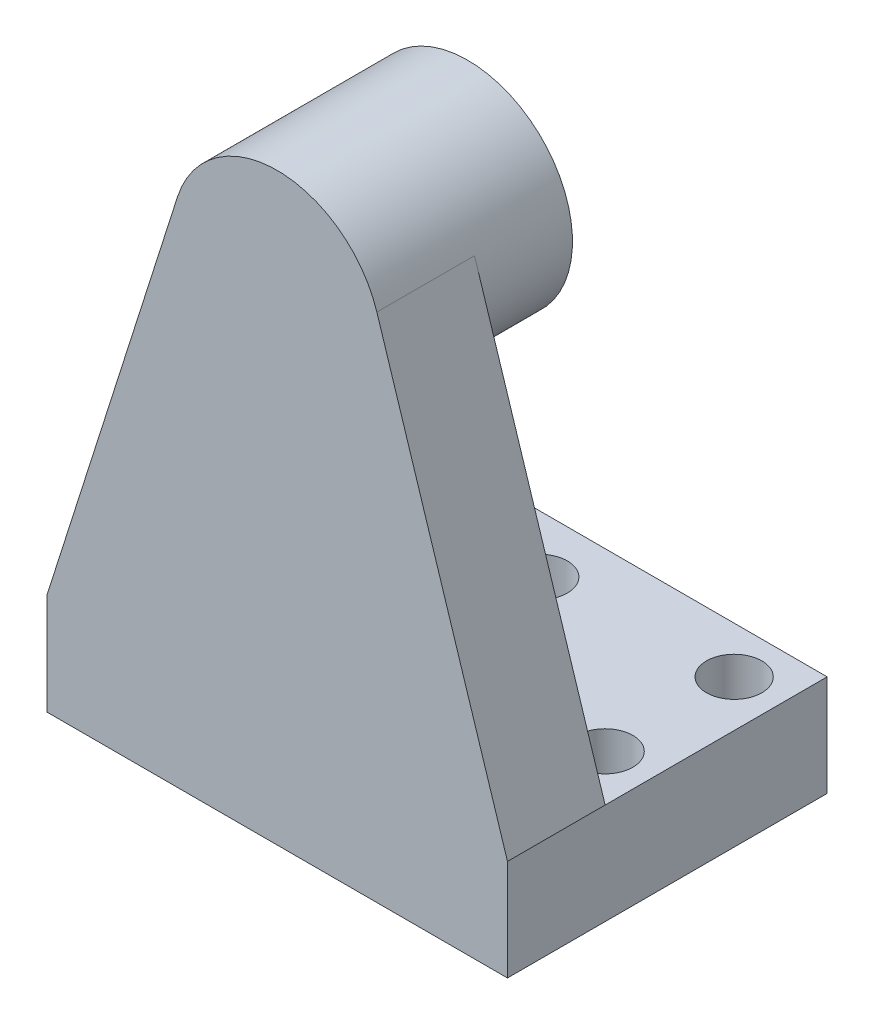
ISO-10303-21;
HEADER;
FILE_DESCRIPTION(('STEP AP214'),'2;1');
FILE_NAME('part.step','',(''),(''),'','','');
FILE_SCHEMA(('AUTOMOTIVE_DESIGN { 1 0 10303 214 1 1 1 1 }'));
ENDSEC;
DATA;
#1=APPLICATION_CONTEXT('core data for automotive mechanical design processes');
#2=APPLICATION_PROTOCOL_DEFINITION('international standard','automotive_design',2000,#1);
#3=PRODUCT_CONTEXT('',#1,'mechanical');
#4=PRODUCT('Part','Part','',(#3));
#5=PRODUCT_RELATED_PRODUCT_CATEGORY('part','',(#4));
#6=PRODUCT_DEFINITION_FORMATION('','',#4);
#7=PRODUCT_DEFINITION_CONTEXT('part definition',#1,'design');
#8=PRODUCT_DEFINITION('design','',#6,#7);
#9=PRODUCT_DEFINITION_SHAPE('','',#8);
#10=(LENGTH_UNIT() NAMED_UNIT(*) SI_UNIT(.MILLI.,.METRE.));
#11=(NAMED_UNIT(*) PLANE_ANGLE_UNIT() SI_UNIT($,.RADIAN.));
#12=(NAMED_UNIT(*) SI_UNIT($,.STERADIAN.) SOLID_ANGLE_UNIT());
#13=UNCERTAINTY_MEASURE_WITH_UNIT(LENGTH_MEASURE(1.E-05),#10,'distance_accuracy_value','');
#14=(GEOMETRIC_REPRESENTATION_CONTEXT(3) GLOBAL_UNCERTAINTY_ASSIGNED_CONTEXT((#13)) GLOBAL_UNIT_ASSIGNED_CONTEXT((#10,
#11,#12)) REPRESENTATION_CONTEXT('',''));
#15=CARTESIAN_POINT('',(0.,0.,0.));
#16=DIRECTION('',(0.,0.,1.));
#17=DIRECTION('',(1.,0.,0.));
#18=AXIS2_PLACEMENT_3D('',#15,#16,#17);
#19=CARTESIAN_POINT('',(-17.71,-17.71,20.));
#20=DIRECTION('',(0.,0.,1.));
#21=DIRECTION('',(1.,0.,0.));
#22=AXIS2_PLACEMENT_3D('',#19,#20,#21);
#23=PLANE('',#22);
#24=CARTESIAN_POINT('',(0.,0.,20.));
#25=DIRECTION('',(0.,0.,-1.));
#26=DIRECTION('',(0.,1.,0.));
#27=AXIS2_PLACEMENT_3D('',#24,#25,#26);
#28=CIRCLE('',#27,17.5);
#29=CARTESIAN_POINT('',(0.,17.5,20.));
#30=VERTEX_POINT('',#29);
#31=EDGE_CURVE('E20',#30,#30,#28,.F.);
#32=ORIENTED_EDGE('',*,*,#31,.F.);
#33=EDGE_LOOP('',(#32));
#34=FACE_BOUND('',#33,.T.);
#35=ADVANCED_FACE('F16',(#34),#23,.F.);
#36=CARTESIAN_POINT('',(0.,0.,20.));
#37=DIRECTION('',(0.,0.,-1.));
#38=DIRECTION('',(0.,1.,0.));
#39=AXIS2_PLACEMENT_3D('',#36,#37,#38);
#40=CYLINDRICAL_SURFACE('',#39,17.5);
#41=CARTESIAN_POINT('',(0.,0.,0.));
#42=DIRECTION('',(0.,0.,-1.));
#43=DIRECTION('',(0.,1.,0.));
#44=AXIS2_PLACEMENT_3D('',#41,#42,#43);
#45=CIRCLE('',#44,17.5);
#46=CARTESIAN_POINT('',(0.,17.5,0.));
#47=VERTEX_POINT('',#46);
#48=EDGE_CURVE('E103',#47,#47,#45,.T.);
#49=ORIENTED_EDGE('',*,*,#48,.T.);
#50=EDGE_LOOP('',(#49));
#51=FACE_BOUND('',#50,.T.);
#52=ORIENTED_EDGE('',*,*,#31,.T.);
#53=EDGE_LOOP('',(#52));
#54=FACE_BOUND('',#53,.T.);
#55=ADVANCED_FACE('F110',(#51,#54),#40,.F.);
#56=CARTESIAN_POINT('',(-22.77,-22.77,0.));
#57=DIRECTION('',(0.,0.,1.));
#58=DIRECTION('',(1.,0.,0.));
#59=AXIS2_PLACEMENT_3D('',#56,#57,#58);
#60=PLANE('',#59);
#61=ORIENTED_EDGE('',*,*,#48,.F.);
#62=EDGE_LOOP('',(#61));
#63=FACE_BOUND('',#62,.T.);
#64=CARTESIAN_POINT('',(0.,0.,0.));
#65=DIRECTION('',(0.,0.,-1.));
#66=DIRECTION('',(-1.,0.,0.));
#67=AXIS2_PLACEMENT_3D('',#64,#65,#66);
#68=CIRCLE('',#67,22.5);
#69=CARTESIAN_POINT('',(-22.5,0.,0.));
#70=VERTEX_POINT('',#69);
#71=EDGE_CURVE('E101',#70,#70,#68,.T.);
#72=ORIENTED_EDGE('',*,*,#71,.T.);
#73=EDGE_LOOP('',(#72));
#74=FACE_BOUND('',#73,.T.);
#75=ADVANCED_FACE('F118',(#63,#74),#60,.F.);
#76=CARTESIAN_POINT('',(0.,0.,41.));
#77=DIRECTION('',(0.,0.,-1.));
#78=DIRECTION('',(-1.,0.,0.));
#79=AXIS2_PLACEMENT_3D('',#76,#77,#78);
#80=CYLINDRICAL_SURFACE('',#79,22.5);
#81=ORIENTED_EDGE('',*,*,#71,.F.);
#82=EDGE_LOOP('',(#81));
#83=FACE_BOUND('',#82,.T.);
#84=DIRECTION('',(0.,0.,-1.));
#85=VECTOR('',#84,1.);
#86=CARTESIAN_POINT('',(21.440276778,6.8238209,30.5));
#87=LINE('',#86,#85);
#88=CARTESIAN_POINT('',(21.4402767586442,6.82382089771802,41.));
#89=VERTEX_POINT('',#88);
#90=CARTESIAN_POINT('',(21.4402767780002,6.82382089999947,19.999999999));
#91=VERTEX_POINT('',#90);
#92=EDGE_CURVE('E84',#89,#91,#87,.T.);
#93=ORIENTED_EDGE('',*,*,#92,.T.);
#94=CARTESIAN_POINT('',(0.,0.,19.999999998));
#95=DIRECTION('',(0.,0.,-1.));
#96=DIRECTION('',(-1.,0.,0.));
#97=AXIS2_PLACEMENT_3D('',#94,#95,#96);
#98=CIRCLE('',#97,22.5);
#99=CARTESIAN_POINT('',(-21.4402767780002,6.82382089999948,19.999999999));
#100=VERTEX_POINT('',#99);
#101=EDGE_CURVE('E78',#91,#100,#98,.T.);
#102=ORIENTED_EDGE('',*,*,#101,.T.);
#103=DIRECTION('',(0.,0.,1.));
#104=VECTOR('',#103,1.);
#105=CARTESIAN_POINT('',(-21.440276778,6.8238209,30.5));
#106=LINE('',#105,#104);
#107=CARTESIAN_POINT('',(-21.4402767586442,6.82382089771802,41.));
#108=VERTEX_POINT('',#107);
#109=EDGE_CURVE('E73',#100,#108,#106,.T.);
#110=ORIENTED_EDGE('',*,*,#109,.T.);
#111=CARTESIAN_POINT('',(0.,0.,41.));
#112=DIRECTION('',(0.,0.,-1.));
#113=DIRECTION('',(-1.,0.,0.));
#114=AXIS2_PLACEMENT_3D('',#111,#112,#113);
#115=CIRCLE('',#114,22.5);
#116=EDGE_CURVE('E77',#89,#108,#115,.F.);
#117=ORIENTED_EDGE('',*,*,#116,.F.);
#118=EDGE_LOOP('',(#93,#102,#110,#117));
#119=FACE_BOUND('',#118,.T.);
#120=ADVANCED_FACE('F76',(#83,#119),#80,.T.);
#121=CARTESIAN_POINT('',(21.440276778,6.8238209,20.));
#122=DIRECTION('',(-0.952901190140385,-0.303280928891082,0.));
#123=DIRECTION('',(0.303280928891082,-0.952901190140385,0.));
#124=AXIS2_PLACEMENT_3D('',#121,#122,#123);
#125=PLANE('',#124);
#126=ORIENTED_EDGE('',*,*,#92,.F.);
#127=DIRECTION('',(-0.303280929204166,0.95290119004074,0.));
#128=VECTOR('',#127,1.);
#129=CARTESIAN_POINT('',(49.529318223,-81.4312537878578,41.));
#130=LINE('',#129,#128);
#131=CARTESIAN_POINT('',(49.529318223,-81.4312537749289,41.));
#132=VERTEX_POINT('',#131);
#133=EDGE_CURVE('E93',#132,#89,#130,.T.);
#134=ORIENTED_EDGE('',*,*,#133,.F.);
#135=DIRECTION('',(0.,0.,-1.));
#136=VECTOR('',#135,1.);
#137=CARTESIAN_POINT('',(49.529318223,-81.431253762,6.628008068));
#138=LINE('',#137,#136);
#139=CARTESIAN_POINT('',(49.529318223,-81.431253762,20.));
#140=VERTEX_POINT('',#139);
#141=EDGE_CURVE('E230',#132,#140,#138,.T.);
#142=ORIENTED_EDGE('',*,*,#141,.T.);
#143=DIRECTION('',(0.303280928891082,-0.952901190140385,0.));
#144=VECTOR('',#143,1.);
#145=CARTESIAN_POINT('',(21.440276778,6.8238209,20.));
#146=LINE('',#145,#144);
#147=EDGE_CURVE('E244',#140,#91,#146,.F.);
#148=ORIENTED_EDGE('',*,*,#147,.T.);
#149=EDGE_LOOP('',(#126,#134,#142,#148));
#150=FACE_BOUND('',#149,.T.);
#151=ADVANCED_FACE('F150',(#150),#125,.F.);
#152=CARTESIAN_POINT('',(-49.529318223,-81.431253762,20.));
#153=DIRECTION('',(0.952901190140385,-0.303280928891082,0.));
#154=DIRECTION('',(0.303280928891082,0.952901190140385,0.));
#155=AXIS2_PLACEMENT_3D('',#152,#153,#154);
#156=PLANE('',#155);
#157=DIRECTION('',(0.,0.,1.));
#158=VECTOR('',#157,1.);
#159=CARTESIAN_POINT('',(-49.529318223,-81.431253762,6.628008068));
#160=LINE('',#159,#158);
#161=CARTESIAN_POINT('',(-49.529318223,-81.431253762,20.));
#162=VERTEX_POINT('',#161);
#163=CARTESIAN_POINT('',(-49.529318223,-81.4312537749289,41.));
#164=VERTEX_POINT('',#163);
#165=EDGE_CURVE('E97',#162,#164,#160,.T.);
#166=ORIENTED_EDGE('',*,*,#165,.T.);
#167=DIRECTION('',(-0.303280929204166,-0.952901190040739,0.));
#168=VECTOR('',#167,1.);
#169=CARTESIAN_POINT('',(-21.4402767304418,6.82382092323203,41.));
#170=LINE('',#169,#168);
#171=EDGE_CURVE('E83',#108,#164,#170,.T.);
#172=ORIENTED_EDGE('',*,*,#171,.F.);
#173=ORIENTED_EDGE('',*,*,#109,.F.);
#174=DIRECTION('',(0.303280928891082,0.952901190140385,0.));
#175=VECTOR('',#174,1.);
#176=CARTESIAN_POINT('',(-49.529318223,-81.431253762,20.));
#177=LINE('',#176,#175);
#178=EDGE_CURVE('E264',#100,#162,#177,.F.);
#179=ORIENTED_EDGE('',*,*,#178,.T.);
#180=EDGE_LOOP('',(#166,#172,#173,#179));
#181=FACE_BOUND('',#180,.T.);
#182=ADVANCED_FACE('F96',(#181),#156,.F.);
#183=CARTESIAN_POINT('',(-49.529318223,-103.146254765,41.));
#184=DIRECTION('',(0.,0.,1.));
#185=DIRECTION('',(1.,0.,0.));
#186=AXIS2_PLACEMENT_3D('',#183,#184,#185);
#187=PLANE('',#186);
#188=ORIENTED_EDGE('',*,*,#133,.T.);
#189=ORIENTED_EDGE('',*,*,#116,.T.);
#190=ORIENTED_EDGE('',*,*,#171,.T.);
#191=DIRECTION('',(0.,-1.,0.));
#192=VECTOR('',#191,1.);
#193=CARTESIAN_POINT('',(-49.529318223,-92.2887542635,41.));
#194=LINE('',#193,#192);
#195=CARTESIAN_POINT('',(-49.529318223,-103.146254765,41.));
#196=VERTEX_POINT('',#195);
#197=EDGE_CURVE('E228',#164,#196,#194,.T.);
#198=ORIENTED_EDGE('',*,*,#197,.T.);
#199=DIRECTION('',(1.,0.,0.));
#200=VECTOR('',#199,1.);
#201=CARTESIAN_POINT('',(0.,-103.146254765,41.));
#202=LINE('',#201,#200);
#203=CARTESIAN_POINT('',(49.529318223,-103.146254765,41.));
#204=VERTEX_POINT('',#203);
#205=EDGE_CURVE('E221',#196,#204,#202,.T.);
#206=ORIENTED_EDGE('',*,*,#205,.T.);
#207=DIRECTION('',(0.,1.,0.));
#208=VECTOR('',#207,1.);
#209=CARTESIAN_POINT('',(49.529318223,-92.2887542635,41.));
#210=LINE('',#209,#208);
#211=EDGE_CURVE('E220',#204,#132,#210,.T.);
#212=ORIENTED_EDGE('',*,*,#211,.T.);
#213=EDGE_LOOP('',(#188,#189,#190,#198,#206,#212));
#214=FACE_BOUND('',#213,.T.);
#215=ADVANCED_FACE('F89',(#214),#187,.T.);
#216=CARTESIAN_POINT('',(-50.123670041,-81.431253762,20.));
#217=DIRECTION('',(0.,0.,1.));
#218=DIRECTION('',(1.,0.,0.));
#219=AXIS2_PLACEMENT_3D('',#216,#217,#218);
#220=PLANE('',#219);
#221=DIRECTION('',(1.,0.,0.));
#222=VECTOR('',#221,1.);
#223=CARTESIAN_POINT('',(0.,-81.431253762,20.));
#224=LINE('',#223,#222);
#225=EDGE_CURVE('E232',#162,#140,#224,.T.);
#226=ORIENTED_EDGE('',*,*,#225,.F.);
#227=ORIENTED_EDGE('',*,*,#178,.F.);
#228=ORIENTED_EDGE('',*,*,#101,.F.);
#229=ORIENTED_EDGE('',*,*,#147,.F.);
#230=EDGE_LOOP('',(#226,#227,#228,#229));
#231=FACE_BOUND('',#230,.T.);
#232=ADVANCED_FACE('F168',(#231),#220,.F.);
#233=CARTESIAN_POINT('',(49.529318223,-103.146254765,-27.743983864));
#234=DIRECTION('',(-1.,0.,0.));
#235=DIRECTION('',(0.,0.,1.));
#236=AXIS2_PLACEMENT_3D('',#233,#234,#235);
#237=PLANE('',#236);
#238=DIRECTION('',(0.,-1.,0.));
#239=VECTOR('',#238,1.);
#240=CARTESIAN_POINT('',(49.529318223,-92.2887542635,-27.743983864));
#241=LINE('',#240,#239);
#242=CARTESIAN_POINT('',(49.529318223,-81.431253762,-27.743983864));
#243=VERTEX_POINT('',#242);
#244=CARTESIAN_POINT('',(49.529318223,-103.146254765,-27.743983864));
#245=VERTEX_POINT('',#244);
#246=EDGE_CURVE('E218',#243,#245,#241,.T.);
#247=ORIENTED_EDGE('',*,*,#246,.F.);
#248=DIRECTION('',(0.,0.,-1.));
#249=VECTOR('',#248,1.);
#250=CARTESIAN_POINT('',(49.529318223,-81.431253762,-3.871991932));
#251=LINE('',#250,#249);
#252=EDGE_CURVE('E235',#140,#243,#251,.T.);
#253=ORIENTED_EDGE('',*,*,#252,.F.);
#254=ORIENTED_EDGE('',*,*,#141,.F.);
#255=ORIENTED_EDGE('',*,*,#211,.F.);
#256=DIRECTION('',(0.,0.,-1.));
#257=VECTOR('',#256,1.);
#258=CARTESIAN_POINT('',(49.529318223,-103.146254765,6.628008068));
#259=LINE('',#258,#257);
#260=EDGE_CURVE('E211',#204,#245,#259,.T.);
#261=ORIENTED_EDGE('',*,*,#260,.T.);
#262=EDGE_LOOP('',(#247,#253,#254,#255,#261));
#263=FACE_BOUND('',#262,.T.);
#264=ADVANCED_FACE('F171',(#263),#237,.F.);
#265=CARTESIAN_POINT('',(49.529318223,-103.146254765,-27.743983864));
#266=DIRECTION('',(0.,0.,-1.));
#267=DIRECTION('',(-1.,0.,0.));
#268=AXIS2_PLACEMENT_3D('',#265,#266,#267);
#269=PLANE('',#268);
#270=DIRECTION('',(-1.,0.,0.));
#271=VECTOR('',#270,1.);
#272=CARTESIAN_POINT('',(0.,-81.431253762,-27.743983864));
#273=LINE('',#272,#271);
#274=CARTESIAN_POINT('',(-49.529318223,-81.431253762,-27.743983864));
#275=VERTEX_POINT('',#274);
#276=EDGE_CURVE('E35',#243,#275,#273,.T.);
#277=ORIENTED_EDGE('',*,*,#276,.F.);
#278=ORIENTED_EDGE('',*,*,#246,.T.);
#279=DIRECTION('',(-1.,0.,0.));
#280=VECTOR('',#279,1.);
#281=CARTESIAN_POINT('',(0.,-103.146254765,-27.743983864));
#282=LINE('',#281,#280);
#283=CARTESIAN_POINT('',(-49.529318223,-103.146254765,-27.743983864));
#284=VERTEX_POINT('',#283);
#285=EDGE_CURVE('E209',#245,#284,#282,.T.);
#286=ORIENTED_EDGE('',*,*,#285,.T.);
#287=DIRECTION('',(0.,1.,0.));
#288=VECTOR('',#287,1.);
#289=CARTESIAN_POINT('',(-49.529318223,-92.2887542635,-27.743983864));
#290=LINE('',#289,#288);
#291=EDGE_CURVE('E226',#284,#275,#290,.T.);
#292=ORIENTED_EDGE('',*,*,#291,.T.);
#293=EDGE_LOOP('',(#277,#278,#286,#292));
#294=FACE_BOUND('',#293,.T.);
#295=ADVANCED_FACE('F175',(#294),#269,.T.);
#296=CARTESIAN_POINT('',(-49.529318223,-103.146254765,41.));
#297=DIRECTION('',(1.,0.,0.));
#298=DIRECTION('',(0.,0.,-1.));
#299=AXIS2_PLACEMENT_3D('',#296,#297,#298);
#300=PLANE('',#299);
#301=DIRECTION('',(0.,0.,1.));
#302=VECTOR('',#301,1.);
#303=CARTESIAN_POINT('',(-49.529318223,-81.431253762,-3.871991932));
#304=LINE('',#303,#302);
#305=EDGE_CURVE('E240',#275,#162,#304,.T.);
#306=ORIENTED_EDGE('',*,*,#305,.F.);
#307=ORIENTED_EDGE('',*,*,#291,.F.);
#308=DIRECTION('',(0.,0.,1.));
#309=VECTOR('',#308,1.);
#310=CARTESIAN_POINT('',(-49.529318223,-103.146254765,6.628008068));
#311=LINE('',#310,#309);
#312=EDGE_CURVE('E214',#284,#196,#311,.T.);
#313=ORIENTED_EDGE('',*,*,#312,.T.);
#314=ORIENTED_EDGE('',*,*,#197,.F.);
#315=ORIENTED_EDGE('',*,*,#165,.F.);
#316=EDGE_LOOP('',(#306,#307,#313,#314,#315));
#317=FACE_BOUND('',#316,.T.);
#318=ADVANCED_FACE('F147',(#317),#300,.F.);
#319=CARTESIAN_POINT('',(-39.529318223,-103.146254765,-17.743983864));
#320=DIRECTION('',(0.,1.,0.));
#321=DIRECTION('',(0.,0.,1.));
#322=AXIS2_PLACEMENT_3D('',#319,#320,#321);
#323=CYLINDRICAL_SURFACE('',#322,5.95249);
#324=CARTESIAN_POINT('',(-39.529318223,-81.431253762,-17.743983864));
#325=DIRECTION('',(0.,1.,0.));
#326=DIRECTION('',(0.,0.,1.));
#327=AXIS2_PLACEMENT_3D('',#324,#325,#326);
#328=CIRCLE('',#327,5.95249);
#329=CARTESIAN_POINT('',(-39.529318223,-81.431253762,-11.791493864));
#330=VERTEX_POINT('',#329);
#331=EDGE_CURVE('E242',#330,#330,#328,.F.);
#332=ORIENTED_EDGE('',*,*,#331,.F.);
#333=EDGE_LOOP('',(#332));
#334=FACE_BOUND('',#333,.T.);
#335=CARTESIAN_POINT('',(-39.529318223,-103.146254765,-17.743983864));
#336=DIRECTION('',(0.,1.,0.));
#337=DIRECTION('',(0.,0.,1.));
#338=AXIS2_PLACEMENT_3D('',#335,#336,#337);
#339=CIRCLE('',#338,5.95249);
#340=CARTESIAN_POINT('',(-39.529318223,-103.146254765,-11.791493864));
#341=VERTEX_POINT('',#340);
#342=EDGE_CURVE('E201',#341,#341,#339,.F.);
#343=ORIENTED_EDGE('',*,*,#342,.T.);
#344=EDGE_LOOP('',(#343));
#345=FACE_BOUND('',#344,.T.);
#346=ADVANCED_FACE('F143',(#334,#345),#323,.F.);
#347=CARTESIAN_POINT('',(-39.529318223,-103.146254765,10.));
#348=DIRECTION('',(0.,1.,0.));
#349=DIRECTION('',(0.,0.,1.));
#350=AXIS2_PLACEMENT_3D('',#347,#348,#349);
#351=CYLINDRICAL_SURFACE('',#350,5.95249);
#352=CARTESIAN_POINT('',(-39.529318223,-81.431253762,10.));
#353=DIRECTION('',(0.,1.,0.));
#354=DIRECTION('',(0.,0.,1.));
#355=AXIS2_PLACEMENT_3D('',#352,#353,#354);
#356=CIRCLE('',#355,5.95249);
#357=CARTESIAN_POINT('',(-39.529318223,-81.431253762,15.95249));
#358=VERTEX_POINT('',#357);
#359=EDGE_CURVE('E253',#358,#358,#356,.F.);
#360=ORIENTED_EDGE('',*,*,#359,.F.);
#361=EDGE_LOOP('',(#360));
#362=FACE_BOUND('',#361,.T.);
#363=CARTESIAN_POINT('',(-39.529318223,-103.146254765,10.));
#364=DIRECTION('',(0.,1.,0.));
#365=DIRECTION('',(0.,0.,1.));
#366=AXIS2_PLACEMENT_3D('',#363,#364,#365);
#367=CIRCLE('',#366,5.95249);
#368=CARTESIAN_POINT('',(-39.529318223,-103.146254765,15.95249));
#369=VERTEX_POINT('',#368);
#370=EDGE_CURVE('E197',#369,#369,#367,.F.);
#371=ORIENTED_EDGE('',*,*,#370,.T.);
#372=EDGE_LOOP('',(#371));
#373=FACE_BOUND('',#372,.T.);
#374=ADVANCED_FACE('F139',(#362,#373),#351,.F.);
#375=CARTESIAN_POINT('',(39.529318223,-103.146254765,10.));
#376=DIRECTION('',(0.,1.,0.));
#377=DIRECTION('',(0.,0.,1.));
#378=AXIS2_PLACEMENT_3D('',#375,#376,#377);
#379=CYLINDRICAL_SURFACE('',#378,5.95249);
#380=CARTESIAN_POINT('',(39.529318223,-81.431253762,10.));
#381=DIRECTION('',(0.,1.,0.));
#382=DIRECTION('',(0.,0.,1.));
#383=AXIS2_PLACEMENT_3D('',#380,#381,#382);
#384=CIRCLE('',#383,5.95249);
#385=CARTESIAN_POINT('',(39.529318223,-81.431253762,15.95249));
#386=VERTEX_POINT('',#385);
#387=EDGE_CURVE('E250',#386,#386,#384,.F.);
#388=ORIENTED_EDGE('',*,*,#387,.F.);
#389=EDGE_LOOP('',(#388));
#390=FACE_BOUND('',#389,.T.);
#391=CARTESIAN_POINT('',(39.529318223,-103.146254765,10.));
#392=DIRECTION('',(0.,1.,0.));
#393=DIRECTION('',(0.,0.,1.));
#394=AXIS2_PLACEMENT_3D('',#391,#392,#393);
#395=CIRCLE('',#394,5.95249);
#396=CARTESIAN_POINT('',(39.529318223,-103.146254765,15.95249));
#397=VERTEX_POINT('',#396);
#398=EDGE_CURVE('E193',#397,#397,#395,.F.);
#399=ORIENTED_EDGE('',*,*,#398,.T.);
#400=EDGE_LOOP('',(#399));
#401=FACE_BOUND('',#400,.T.);
#402=ADVANCED_FACE('F135',(#390,#401),#379,.F.);
#403=CARTESIAN_POINT('',(0.,-103.146254765,-15.406497002));
#404=DIRECTION('',(0.,1.,0.));
#405=DIRECTION('',(0.,0.,1.));
#406=AXIS2_PLACEMENT_3D('',#403,#404,#405);
#407=CYLINDRICAL_SURFACE('',#406,6.);
#408=CARTESIAN_POINT('',(0.,-81.431253762,-15.406497002));
#409=DIRECTION('',(0.,1.,0.));
#410=DIRECTION('',(0.,0.,1.));
#411=AXIS2_PLACEMENT_3D('',#408,#409,#410);
#412=CIRCLE('',#411,6.);
#413=CARTESIAN_POINT('',(0.,-81.431253762,-9.406497002));
#414=VERTEX_POINT('',#413);
#415=EDGE_CURVE('E247',#414,#414,#412,.F.);
#416=ORIENTED_EDGE('',*,*,#415,.F.);
#417=EDGE_LOOP('',(#416));
#418=FACE_BOUND('',#417,.T.);
#419=CARTESIAN_POINT('',(0.,-103.146254765,-15.406497002));
#420=DIRECTION('',(0.,1.,0.));
#421=DIRECTION('',(0.,0.,1.));
#422=AXIS2_PLACEMENT_3D('',#419,#420,#421);
#423=CIRCLE('',#422,6.);
#424=CARTESIAN_POINT('',(0.,-103.146254765,-9.406497002));
#425=VERTEX_POINT('',#424);
#426=EDGE_CURVE('E189',#425,#425,#423,.F.);
#427=ORIENTED_EDGE('',*,*,#426,.T.);
#428=EDGE_LOOP('',(#427));
#429=FACE_BOUND('',#428,.T.);
#430=ADVANCED_FACE('F132',(#418,#429),#407,.F.);
#431=CARTESIAN_POINT('',(-49.529318223,-103.146254765,-27.743983864));
#432=DIRECTION('',(0.,1.,0.));
#433=DIRECTION('',(0.,0.,1.));
#434=AXIS2_PLACEMENT_3D('',#431,#432,#433);
#435=PLANE('',#434);
#436=ORIENTED_EDGE('',*,*,#426,.F.);
#437=EDGE_LOOP('',(#436));
#438=FACE_BOUND('',#437,.T.);
#439=ORIENTED_EDGE('',*,*,#398,.F.);
#440=EDGE_LOOP('',(#439));
#441=FACE_BOUND('',#440,.T.);
#442=ORIENTED_EDGE('',*,*,#370,.F.);
#443=EDGE_LOOP('',(#442));
#444=FACE_BOUND('',#443,.T.);
#445=ORIENTED_EDGE('',*,*,#342,.F.);
#446=EDGE_LOOP('',(#445));
#447=FACE_BOUND('',#446,.T.);
#448=CARTESIAN_POINT('',(39.529318223,-103.146254765,-17.743983864));
#449=DIRECTION('',(0.,1.,0.));
#450=DIRECTION('',(0.,0.,1.));
#451=AXIS2_PLACEMENT_3D('',#448,#449,#450);
#452=CIRCLE('',#451,5.95249);
#453=CARTESIAN_POINT('',(39.529318223,-103.146254765,-11.791493864));
#454=VERTEX_POINT('',#453);
#455=EDGE_CURVE('E26',#454,#454,#452,.F.);
#456=ORIENTED_EDGE('',*,*,#455,.F.);
#457=EDGE_LOOP('',(#456));
#458=FACE_BOUND('',#457,.T.);
#459=ORIENTED_EDGE('',*,*,#285,.F.);
#460=ORIENTED_EDGE('',*,*,#260,.F.);
#461=ORIENTED_EDGE('',*,*,#205,.F.);
#462=ORIENTED_EDGE('',*,*,#312,.F.);
#463=EDGE_LOOP('',(#459,#460,#461,#462));
#464=FACE_BOUND('',#463,.T.);
#465=ADVANCED_FACE('F128',(#438,#441,#444,#447,#458,#464),#435,.F.);
#466=CARTESIAN_POINT('',(-49.529318223,-81.431253762,-27.743983864));
#467=DIRECTION('',(0.,1.,0.));
#468=DIRECTION('',(0.,0.,1.));
#469=AXIS2_PLACEMENT_3D('',#466,#467,#468);
#470=PLANE('',#469);
#471=ORIENTED_EDGE('',*,*,#415,.T.);
#472=EDGE_LOOP('',(#471));
#473=FACE_BOUND('',#472,.T.);
#474=ORIENTED_EDGE('',*,*,#387,.T.);
#475=EDGE_LOOP('',(#474));
#476=FACE_BOUND('',#475,.T.);
#477=ORIENTED_EDGE('',*,*,#359,.T.);
#478=EDGE_LOOP('',(#477));
#479=FACE_BOUND('',#478,.T.);
#480=ORIENTED_EDGE('',*,*,#331,.T.);
#481=EDGE_LOOP('',(#480));
#482=FACE_BOUND('',#481,.T.);
#483=CARTESIAN_POINT('',(39.529318223,-81.431253762,-17.743983864));
#484=DIRECTION('',(0.,1.,0.));
#485=DIRECTION('',(0.,0.,1.));
#486=AXIS2_PLACEMENT_3D('',#483,#484,#485);
#487=CIRCLE('',#486,5.95249);
#488=CARTESIAN_POINT('',(39.529318223,-81.431253762,-11.791493864));
#489=VERTEX_POINT('',#488);
#490=EDGE_CURVE('E10',#489,#489,#487,.T.);
#491=ORIENTED_EDGE('',*,*,#490,.F.);
#492=EDGE_LOOP('',(#491));
#493=FACE_BOUND('',#492,.T.);
#494=ORIENTED_EDGE('',*,*,#276,.T.);
#495=ORIENTED_EDGE('',*,*,#305,.T.);
#496=ORIENTED_EDGE('',*,*,#225,.T.);
#497=ORIENTED_EDGE('',*,*,#252,.T.);
#498=EDGE_LOOP('',(#494,#495,#496,#497));
#499=FACE_BOUND('',#498,.T.);
#500=ADVANCED_FACE('F18',(#473,#476,#479,#482,#493,#499),#470,.T.);
#501=CARTESIAN_POINT('',(39.529318223,-103.146254765,-17.743983864));
#502=DIRECTION('',(0.,1.,0.));
#503=DIRECTION('',(0.,0.,1.));
#504=AXIS2_PLACEMENT_3D('',#501,#502,#503);
#505=CYLINDRICAL_SURFACE('',#504,5.95249);
#506=ORIENTED_EDGE('',*,*,#490,.T.);
#507=EDGE_LOOP('',(#506));
#508=FACE_BOUND('',#507,.T.);
#509=ORIENTED_EDGE('',*,*,#455,.T.);
#510=EDGE_LOOP('',(#509));
#511=FACE_BOUND('',#510,.T.);
#512=ADVANCED_FACE('F121',(#508,#511),#505,.F.);
#513=CLOSED_SHELL('',(#35,#55,#75,#120,#151,#182,#215,#232,#264,#295,#318,#346,#374,#402,#430,
#465,#500,#512));
#514=MANIFOLD_SOLID_BREP('B1',#513);
#515=ADVANCED_BREP_SHAPE_REPRESENTATION('',(#18,#514),#14);
#516=SHAPE_DEFINITION_REPRESENTATION(#9,#515);
ENDSEC;
END-ISO-10303-21;
